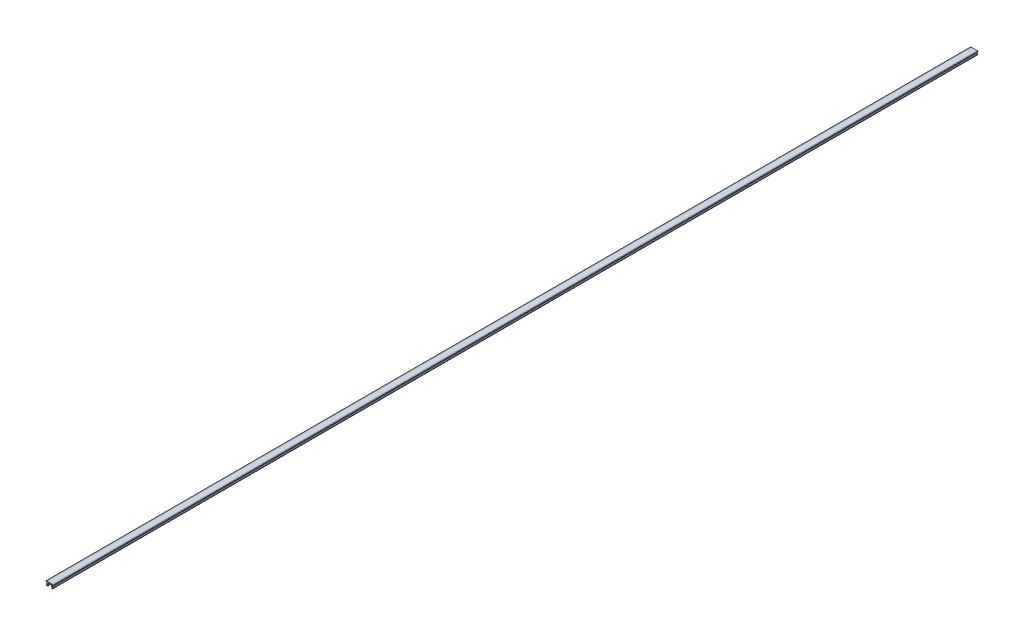
ISO-10303-21;
HEADER;
FILE_DESCRIPTION(('STEP AP214'),'2;1');
FILE_NAME('part.step','',(''),(''),'','','');
FILE_SCHEMA(('AUTOMOTIVE_DESIGN { 1 0 10303 214 1 1 1 1 }'));
ENDSEC;
DATA;
#1=APPLICATION_CONTEXT('core data for automotive mechanical design processes');
#2=APPLICATION_PROTOCOL_DEFINITION('international standard','automotive_design',2000,#1);
#3=PRODUCT_CONTEXT('',#1,'mechanical');
#4=PRODUCT('Part','Part','',(#3));
#5=PRODUCT_RELATED_PRODUCT_CATEGORY('part','',(#4));
#6=PRODUCT_DEFINITION_FORMATION('','',#4);
#7=PRODUCT_DEFINITION_CONTEXT('part definition',#1,'design');
#8=PRODUCT_DEFINITION('design','',#6,#7);
#9=PRODUCT_DEFINITION_SHAPE('','',#8);
#10=(LENGTH_UNIT() NAMED_UNIT(*) SI_UNIT(.MILLI.,.METRE.));
#11=(NAMED_UNIT(*) PLANE_ANGLE_UNIT() SI_UNIT($,.RADIAN.));
#12=(NAMED_UNIT(*) SI_UNIT($,.STERADIAN.) SOLID_ANGLE_UNIT());
#13=UNCERTAINTY_MEASURE_WITH_UNIT(LENGTH_MEASURE(1.E-05),#10,'distance_accuracy_value','');
#14=(GEOMETRIC_REPRESENTATION_CONTEXT(3) GLOBAL_UNCERTAINTY_ASSIGNED_CONTEXT((#13)) GLOBAL_UNIT_ASSIGNED_CONTEXT((#10,
#11,#12)) REPRESENTATION_CONTEXT('',''));
#15=CARTESIAN_POINT('',(0.,0.,0.));
#16=DIRECTION('',(0.,0.,1.));
#17=DIRECTION('',(1.,0.,0.));
#18=AXIS2_PLACEMENT_3D('',#15,#16,#17);
#19=CARTESIAN_POINT('',(-3.1,0.,1000.));
#20=DIRECTION('',(0.,-1.,0.));
#21=DIRECTION('',(1.,0.,0.));
#22=AXIS2_PLACEMENT_3D('',#19,#20,#21);
#23=PLANE('',#22);
#24=DIRECTION('',(-1.,0.,0.));
#25=VECTOR('',#24,1.);
#26=CARTESIAN_POINT('',(-3.1,0.,0.));
#27=LINE('',#26,#25);
#28=CARTESIAN_POINT('',(3.1,0.,0.));
#29=VERTEX_POINT('',#28);
#30=CARTESIAN_POINT('',(-3.1,0.,0.));
#31=VERTEX_POINT('',#30);
#32=EDGE_CURVE('E215',#29,#31,#27,.T.);
#33=ORIENTED_EDGE('',*,*,#32,.T.);
#34=DIRECTION('',(0.,0.,-1.));
#35=VECTOR('',#34,1.);
#36=CARTESIAN_POINT('',(-3.1,0.,1000.));
#37=LINE('',#36,#35);
#38=CARTESIAN_POINT('',(-3.1,0.,1000.));
#39=VERTEX_POINT('',#38);
#40=EDGE_CURVE('E11',#39,#31,#37,.T.);
#41=ORIENTED_EDGE('',*,*,#40,.F.);
#42=DIRECTION('',(-1.,0.,0.));
#43=VECTOR('',#42,1.);
#44=CARTESIAN_POINT('',(-3.1,0.,1000.));
#45=LINE('',#44,#43);
#46=CARTESIAN_POINT('',(3.1,0.,1000.));
#47=VERTEX_POINT('',#46);
#48=EDGE_CURVE('E257',#47,#39,#45,.T.);
#49=ORIENTED_EDGE('',*,*,#48,.F.);
#50=DIRECTION('',(0.,0.,-1.));
#51=VECTOR('',#50,1.);
#52=CARTESIAN_POINT('',(3.1,0.,1000.));
#53=LINE('',#52,#51);
#54=EDGE_CURVE('E211',#47,#29,#53,.T.);
#55=ORIENTED_EDGE('',*,*,#54,.T.);
#56=EDGE_LOOP('',(#33,#41,#49,#55));
#57=FACE_BOUND('',#56,.T.);
#58=ADVANCED_FACE('F35',(#57),#23,.F.);
#59=CARTESIAN_POINT('',(-3.1,0.,1000.));
#60=DIRECTION('',(0.173648177666924,-0.984807753012209,0.));
#61=DIRECTION('',(0.984807753012209,0.173648177666924,0.));
#62=AXIS2_PLACEMENT_3D('',#59,#60,#61);
#63=PLANE('',#62);
#64=DIRECTION('',(-0.984807753012209,-0.173648177666924,0.));
#65=VECTOR('',#64,1.);
#66=CARTESIAN_POINT('',(-3.1,0.,0.));
#67=LINE('',#66,#65);
#68=CARTESIAN_POINT('',(-4.,-0.158694282637612,0.));
#69=VERTEX_POINT('',#68);
#70=EDGE_CURVE('E218',#31,#69,#67,.T.);
#71=ORIENTED_EDGE('',*,*,#70,.T.);
#72=DIRECTION('',(0.,0.,-1.));
#73=VECTOR('',#72,1.);
#74=CARTESIAN_POINT('',(-4.,-0.158694282637612,1000.));
#75=LINE('',#74,#73);
#76=CARTESIAN_POINT('',(-4.,-0.158694282637612,1000.));
#77=VERTEX_POINT('',#76);
#78=EDGE_CURVE('E43',#77,#69,#75,.T.);
#79=ORIENTED_EDGE('',*,*,#78,.F.);
#80=DIRECTION('',(-0.984807753012209,-0.173648177666924,0.));
#81=VECTOR('',#80,1.);
#82=CARTESIAN_POINT('',(-3.1,0.,1000.));
#83=LINE('',#82,#81);
#84=EDGE_CURVE('E136',#39,#77,#83,.T.);
#85=ORIENTED_EDGE('',*,*,#84,.F.);
#86=ORIENTED_EDGE('',*,*,#40,.T.);
#87=EDGE_LOOP('',(#71,#79,#85,#86));
#88=FACE_BOUND('',#87,.T.);
#89=ADVANCED_FACE('F385',(#88),#63,.F.);
#90=CARTESIAN_POINT('',(-4.,-0.158694282637612,1000.));
#91=DIRECTION('',(1.,0.,0.));
#92=DIRECTION('',(0.,0.,-1.));
#93=AXIS2_PLACEMENT_3D('',#90,#91,#92);
#94=PLANE('',#93);
#95=DIRECTION('',(0.,-1.,0.));
#96=VECTOR('',#95,1.);
#97=CARTESIAN_POINT('',(-4.,-0.158694282637612,0.));
#98=LINE('',#97,#96);
#99=CARTESIAN_POINT('',(-4.,-0.8,0.));
#100=VERTEX_POINT('',#99);
#101=EDGE_CURVE('E220',#69,#100,#98,.T.);
#102=ORIENTED_EDGE('',*,*,#101,.T.);
#103=DIRECTION('',(0.,0.,-1.));
#104=VECTOR('',#103,1.);
#105=CARTESIAN_POINT('',(-4.,-0.8,1000.));
#106=LINE('',#105,#104);
#107=CARTESIAN_POINT('',(-4.,-0.8,1000.));
#108=VERTEX_POINT('',#107);
#109=EDGE_CURVE('E306',#108,#100,#106,.T.);
#110=ORIENTED_EDGE('',*,*,#109,.F.);
#111=DIRECTION('',(0.,-1.,0.));
#112=VECTOR('',#111,1.);
#113=CARTESIAN_POINT('',(-4.,-0.158694282637612,1000.));
#114=LINE('',#113,#112);
#115=EDGE_CURVE('E314',#77,#108,#114,.T.);
#116=ORIENTED_EDGE('',*,*,#115,.F.);
#117=ORIENTED_EDGE('',*,*,#78,.T.);
#118=EDGE_LOOP('',(#102,#110,#116,#117));
#119=FACE_BOUND('',#118,.T.);
#120=ADVANCED_FACE('F312',(#119),#94,.F.);
#121=CARTESIAN_POINT('',(-4.,-0.8,1000.));
#122=DIRECTION('',(0.,1.,0.));
#123=DIRECTION('',(0.,0.,1.));
#124=AXIS2_PLACEMENT_3D('',#121,#122,#123);
#125=PLANE('',#124);
#126=DIRECTION('',(1.,0.,0.));
#127=VECTOR('',#126,1.);
#128=CARTESIAN_POINT('',(-4.,-0.8,0.));
#129=LINE('',#128,#127);
#130=CARTESIAN_POINT('',(-3.1,-0.8,0.));
#131=VERTEX_POINT('',#130);
#132=EDGE_CURVE('E222',#100,#131,#129,.T.);
#133=ORIENTED_EDGE('',*,*,#132,.T.);
#134=DIRECTION('',(0.,0.,-1.));
#135=VECTOR('',#134,1.);
#136=CARTESIAN_POINT('',(-3.1,-0.8,1000.));
#137=LINE('',#136,#135);
#138=CARTESIAN_POINT('',(-3.1,-0.8,1000.));
#139=VERTEX_POINT('',#138);
#140=EDGE_CURVE('E303',#139,#131,#137,.T.);
#141=ORIENTED_EDGE('',*,*,#140,.F.);
#142=DIRECTION('',(1.,0.,0.));
#143=VECTOR('',#142,1.);
#144=CARTESIAN_POINT('',(-4.,-0.8,1000.));
#145=LINE('',#144,#143);
#146=EDGE_CURVE('E332',#108,#139,#145,.T.);
#147=ORIENTED_EDGE('',*,*,#146,.F.);
#148=ORIENTED_EDGE('',*,*,#109,.T.);
#149=EDGE_LOOP('',(#133,#141,#147,#148));
#150=FACE_BOUND('',#149,.T.);
#151=ADVANCED_FACE('F323',(#150),#125,.F.);
#152=CARTESIAN_POINT('',(-3.1,-0.8,1000.));
#153=DIRECTION('',(1.,0.,0.));
#154=DIRECTION('',(0.,1.,0.));
#155=AXIS2_PLACEMENT_3D('',#152,#153,#154);
#156=PLANE('',#155);
#157=DIRECTION('',(0.,-1.,0.));
#158=VECTOR('',#157,1.);
#159=CARTESIAN_POINT('',(-3.1,-0.8,0.));
#160=LINE('',#159,#158);
#161=CARTESIAN_POINT('',(-3.1,-2.19615242270663,0.));
#162=VERTEX_POINT('',#161);
#163=EDGE_CURVE('E224',#131,#162,#160,.T.);
#164=ORIENTED_EDGE('',*,*,#163,.T.);
#165=DIRECTION('',(0.,0.,-1.));
#166=VECTOR('',#165,1.);
#167=CARTESIAN_POINT('',(-3.1,-2.19615242270663,1000.));
#168=LINE('',#167,#166);
#169=CARTESIAN_POINT('',(-3.1,-2.19615242270663,1000.));
#170=VERTEX_POINT('',#169);
#171=EDGE_CURVE('E300',#170,#162,#168,.T.);
#172=ORIENTED_EDGE('',*,*,#171,.F.);
#173=DIRECTION('',(0.,-1.,0.));
#174=VECTOR('',#173,1.);
#175=CARTESIAN_POINT('',(-3.1,-0.8,1000.));
#176=LINE('',#175,#174);
#177=EDGE_CURVE('E329',#139,#170,#176,.T.);
#178=ORIENTED_EDGE('',*,*,#177,.F.);
#179=ORIENTED_EDGE('',*,*,#140,.T.);
#180=EDGE_LOOP('',(#164,#172,#178,#179));
#181=FACE_BOUND('',#180,.T.);
#182=ADVANCED_FACE('F327',(#181),#156,.F.);
#183=CARTESIAN_POINT('',(-3.1,-2.19615242270663,1000.));
#184=DIRECTION('',(0.866025403784438,-0.500000000000001,0.));
#185=DIRECTION('',(0.500000000000001,0.866025403784438,0.));
#186=AXIS2_PLACEMENT_3D('',#183,#184,#185);
#187=PLANE('',#186);
#188=DIRECTION('',(-0.500000000000001,-0.866025403784438,0.));
#189=VECTOR('',#188,1.);
#190=CARTESIAN_POINT('',(-3.1,-2.19615242270663,0.));
#191=LINE('',#190,#189);
#192=CARTESIAN_POINT('',(-3.68771324027147,-3.21410161513775,0.));
#193=VERTEX_POINT('',#192);
#194=EDGE_CURVE('E226',#162,#193,#191,.T.);
#195=ORIENTED_EDGE('',*,*,#194,.T.);
#196=DIRECTION('',(0.,0.,-1.));
#197=VECTOR('',#196,1.);
#198=CARTESIAN_POINT('',(-3.68771324027147,-3.21410161513775,1000.));
#199=LINE('',#198,#197);
#200=CARTESIAN_POINT('',(-3.68771324027147,-3.21410161513775,1000.));
#201=VERTEX_POINT('',#200);
#202=EDGE_CURVE('E297',#201,#193,#199,.T.);
#203=ORIENTED_EDGE('',*,*,#202,.F.);
#204=DIRECTION('',(-0.500000000000001,-0.866025403784438,0.));
#205=VECTOR('',#204,1.);
#206=CARTESIAN_POINT('',(-3.1,-2.19615242270663,1000.));
#207=LINE('',#206,#205);
#208=EDGE_CURVE('E331',#170,#201,#207,.T.);
#209=ORIENTED_EDGE('',*,*,#208,.F.);
#210=ORIENTED_EDGE('',*,*,#171,.T.);
#211=EDGE_LOOP('',(#195,#203,#209,#210));
#212=FACE_BOUND('',#211,.T.);
#213=ADVANCED_FACE('F398',(#212),#187,.F.);
#214=CARTESIAN_POINT('',(-3.68771324027147,-3.21410161513775,1000.));
#215=DIRECTION('',(0.866025403784438,0.500000000000001,0.));
#216=DIRECTION('',(-0.500000000000001,0.866025403784438,0.));
#217=AXIS2_PLACEMENT_3D('',#214,#215,#216);
#218=PLANE('',#217);
#219=DIRECTION('',(0.500000000000001,-0.866025403784438,0.));
#220=VECTOR('',#219,1.);
#221=CARTESIAN_POINT('',(-3.68771324027147,-3.21410161513775,0.));
#222=LINE('',#221,#220);
#223=CARTESIAN_POINT('',(-3.1,-4.23205080756888,0.));
#224=VERTEX_POINT('',#223);
#225=EDGE_CURVE('E228',#193,#224,#222,.T.);
#226=ORIENTED_EDGE('',*,*,#225,.T.);
#227=DIRECTION('',(0.,0.,-1.));
#228=VECTOR('',#227,1.);
#229=CARTESIAN_POINT('',(-3.1,-4.23205080756888,1000.));
#230=LINE('',#229,#228);
#231=CARTESIAN_POINT('',(-3.1,-4.23205080756888,1000.));
#232=VERTEX_POINT('',#231);
#233=EDGE_CURVE('E294',#232,#224,#230,.T.);
#234=ORIENTED_EDGE('',*,*,#233,.F.);
#235=DIRECTION('',(0.500000000000001,-0.866025403784438,0.));
#236=VECTOR('',#235,1.);
#237=CARTESIAN_POINT('',(-3.68771324027147,-3.21410161513775,1000.));
#238=LINE('',#237,#236);
#239=EDGE_CURVE('E334',#201,#232,#238,.T.);
#240=ORIENTED_EDGE('',*,*,#239,.F.);
#241=ORIENTED_EDGE('',*,*,#202,.T.);
#242=EDGE_LOOP('',(#226,#234,#240,#241));
#243=FACE_BOUND('',#242,.T.);
#244=ADVANCED_FACE('F401',(#243),#218,.F.);
#245=CARTESIAN_POINT('',(-2.63589838486224,-3.96410161513775,1000.));
#246=DIRECTION('',(0.,0.,-1.));
#247=DIRECTION('',(-1.,0.,0.));
#248=AXIS2_PLACEMENT_3D('',#245,#246,#247);
#249=CYLINDRICAL_SURFACE('',#248,0.535898384862246);
#250=CARTESIAN_POINT('',(-2.63589838486224,-3.96410161513775,0.));
#251=DIRECTION('',(0.,0.,1.));
#252=DIRECTION('',(1.,0.,0.));
#253=AXIS2_PLACEMENT_3D('',#250,#251,#252);
#254=CIRCLE('',#253,0.535898384862246);
#255=CARTESIAN_POINT('',(-2.1,-3.96410161513775,0.));
#256=VERTEX_POINT('',#255);
#257=EDGE_CURVE('E230',#224,#256,#254,.T.);
#258=ORIENTED_EDGE('',*,*,#257,.T.);
#259=DIRECTION('',(0.,0.,-1.));
#260=VECTOR('',#259,1.);
#261=CARTESIAN_POINT('',(-2.1,-3.96410161513775,1000.));
#262=LINE('',#261,#260);
#263=CARTESIAN_POINT('',(-2.1,-3.96410161513775,1000.));
#264=VERTEX_POINT('',#263);
#265=EDGE_CURVE('E291',#264,#256,#262,.T.);
#266=ORIENTED_EDGE('',*,*,#265,.F.);
#267=CARTESIAN_POINT('',(-2.63589838486224,-3.96410161513775,1000.));
#268=DIRECTION('',(0.,0.,1.));
#269=DIRECTION('',(1.,0.,0.));
#270=AXIS2_PLACEMENT_3D('',#267,#268,#269);
#271=CIRCLE('',#270,0.535898384862246);
#272=EDGE_CURVE('E340',#232,#264,#271,.T.);
#273=ORIENTED_EDGE('',*,*,#272,.F.);
#274=ORIENTED_EDGE('',*,*,#233,.T.);
#275=EDGE_LOOP('',(#258,#266,#273,#274));
#276=FACE_BOUND('',#275,.T.);
#277=ADVANCED_FACE('F405',(#276),#249,.T.);
#278=CARTESIAN_POINT('',(-2.1,-3.96410161513775,1000.));
#279=DIRECTION('',(-0.866025403784438,-0.500000000000002,0.));
#280=DIRECTION('',(0.500000000000002,-0.866025403784438,0.));
#281=AXIS2_PLACEMENT_3D('',#278,#279,#280);
#282=PLANE('',#281);
#283=DIRECTION('',(-0.500000000000002,0.866025403784438,0.));
#284=VECTOR('',#283,1.);
#285=CARTESIAN_POINT('',(-2.1,-3.96410161513775,0.));
#286=LINE('',#285,#284);
#287=CARTESIAN_POINT('',(-2.53301270189222,-3.21410161513775,0.));
#288=VERTEX_POINT('',#287);
#289=EDGE_CURVE('E232',#256,#288,#286,.T.);
#290=ORIENTED_EDGE('',*,*,#289,.T.);
#291=DIRECTION('',(0.,0.,-1.));
#292=VECTOR('',#291,1.);
#293=CARTESIAN_POINT('',(-2.53301270189222,-3.21410161513775,1000.));
#294=LINE('',#293,#292);
#295=CARTESIAN_POINT('',(-2.53301270189222,-3.21410161513775,1000.));
#296=VERTEX_POINT('',#295);
#297=EDGE_CURVE('E288',#296,#288,#294,.T.);
#298=ORIENTED_EDGE('',*,*,#297,.F.);
#299=DIRECTION('',(-0.500000000000002,0.866025403784438,0.));
#300=VECTOR('',#299,1.);
#301=CARTESIAN_POINT('',(-2.1,-3.96410161513775,1000.));
#302=LINE('',#301,#300);
#303=EDGE_CURVE('E342',#264,#296,#302,.T.);
#304=ORIENTED_EDGE('',*,*,#303,.F.);
#305=ORIENTED_EDGE('',*,*,#265,.T.);
#306=EDGE_LOOP('',(#290,#298,#304,#305));
#307=FACE_BOUND('',#306,.T.);
#308=ADVANCED_FACE('F409',(#307),#282,.F.);
#309=CARTESIAN_POINT('',(-2.53301270189222,-3.21410161513775,1000.));
#310=DIRECTION('',(-0.866025403784438,0.500000000000001,0.));
#311=DIRECTION('',(-0.500000000000001,-0.866025403784438,0.));
#312=AXIS2_PLACEMENT_3D('',#309,#310,#311);
#313=PLANE('',#312);
#314=DIRECTION('',(0.500000000000001,0.866025403784438,0.));
#315=VECTOR('',#314,1.);
#316=CARTESIAN_POINT('',(-2.53301270189222,-3.21410161513775,0.));
#317=LINE('',#316,#315);
#318=CARTESIAN_POINT('',(-2.1,-2.46410161513775,0.));
#319=VERTEX_POINT('',#318);
#320=EDGE_CURVE('E234',#288,#319,#317,.T.);
#321=ORIENTED_EDGE('',*,*,#320,.T.);
#322=DIRECTION('',(0.,0.,-1.));
#323=VECTOR('',#322,1.);
#324=CARTESIAN_POINT('',(-2.1,-2.46410161513775,1000.));
#325=LINE('',#324,#323);
#326=CARTESIAN_POINT('',(-2.1,-2.46410161513775,1000.));
#327=VERTEX_POINT('',#326);
#328=EDGE_CURVE('E285',#327,#319,#325,.T.);
#329=ORIENTED_EDGE('',*,*,#328,.F.);
#330=DIRECTION('',(0.500000000000001,0.866025403784438,0.));
#331=VECTOR('',#330,1.);
#332=CARTESIAN_POINT('',(-2.53301270189222,-3.21410161513775,1000.));
#333=LINE('',#332,#331);
#334=EDGE_CURVE('E344',#296,#327,#333,.T.);
#335=ORIENTED_EDGE('',*,*,#334,.F.);
#336=ORIENTED_EDGE('',*,*,#297,.T.);
#337=EDGE_LOOP('',(#321,#329,#335,#336));
#338=FACE_BOUND('',#337,.T.);
#339=ADVANCED_FACE('F413',(#338),#313,.F.);
#340=CARTESIAN_POINT('',(-2.1,-2.46410161513775,1000.));
#341=DIRECTION('',(-1.,0.,0.));
#342=DIRECTION('',(0.,-1.,0.));
#343=AXIS2_PLACEMENT_3D('',#340,#341,#342);
#344=PLANE('',#343);
#345=DIRECTION('',(0.,1.,0.));
#346=VECTOR('',#345,1.);
#347=CARTESIAN_POINT('',(-2.1,-2.46410161513775,0.));
#348=LINE('',#347,#346);
#349=CARTESIAN_POINT('',(-2.1,-1.,0.));
#350=VERTEX_POINT('',#349);
#351=EDGE_CURVE('E236',#319,#350,#348,.T.);
#352=ORIENTED_EDGE('',*,*,#351,.T.);
#353=DIRECTION('',(0.,0.,-1.));
#354=VECTOR('',#353,1.);
#355=CARTESIAN_POINT('',(-2.1,-1.,1000.));
#356=LINE('',#355,#354);
#357=CARTESIAN_POINT('',(-2.1,-1.,1000.));
#358=VERTEX_POINT('',#357);
#359=EDGE_CURVE('E282',#358,#350,#356,.T.);
#360=ORIENTED_EDGE('',*,*,#359,.F.);
#361=DIRECTION('',(0.,1.,0.));
#362=VECTOR('',#361,1.);
#363=CARTESIAN_POINT('',(-2.1,-2.46410161513775,1000.));
#364=LINE('',#363,#362);
#365=EDGE_CURVE('E346',#327,#358,#364,.T.);
#366=ORIENTED_EDGE('',*,*,#365,.F.);
#367=ORIENTED_EDGE('',*,*,#328,.T.);
#368=EDGE_LOOP('',(#352,#360,#366,#367));
#369=FACE_BOUND('',#368,.T.);
#370=ADVANCED_FACE('F417',(#369),#344,.F.);
#371=CARTESIAN_POINT('',(-2.1,-1.,1000.));
#372=DIRECTION('',(0.,1.,0.));
#373=DIRECTION('',(-1.,0.,0.));
#374=AXIS2_PLACEMENT_3D('',#371,#372,#373);
#375=PLANE('',#374);
#376=DIRECTION('',(1.,0.,0.));
#377=VECTOR('',#376,1.);
#378=CARTESIAN_POINT('',(-2.1,-1.,0.));
#379=LINE('',#378,#377);
#380=CARTESIAN_POINT('',(2.1,-1.,0.));
#381=VERTEX_POINT('',#380);
#382=EDGE_CURVE('E238',#350,#381,#379,.T.);
#383=ORIENTED_EDGE('',*,*,#382,.T.);
#384=DIRECTION('',(0.,0.,-1.));
#385=VECTOR('',#384,1.);
#386=CARTESIAN_POINT('',(2.1,-1.,1000.));
#387=LINE('',#386,#385);
#388=CARTESIAN_POINT('',(2.1,-1.,1000.));
#389=VERTEX_POINT('',#388);
#390=EDGE_CURVE('E279',#389,#381,#387,.T.);
#391=ORIENTED_EDGE('',*,*,#390,.F.);
#392=DIRECTION('',(1.,0.,0.));
#393=VECTOR('',#392,1.);
#394=CARTESIAN_POINT('',(-2.1,-1.,1000.));
#395=LINE('',#394,#393);
#396=EDGE_CURVE('E348',#358,#389,#395,.T.);
#397=ORIENTED_EDGE('',*,*,#396,.F.);
#398=ORIENTED_EDGE('',*,*,#359,.T.);
#399=EDGE_LOOP('',(#383,#391,#397,#398));
#400=FACE_BOUND('',#399,.T.);
#401=ADVANCED_FACE('F421',(#400),#375,.F.);
#402=CARTESIAN_POINT('',(2.1,-2.46410161513775,1000.));
#403=DIRECTION('',(1.,0.,0.));
#404=DIRECTION('',(0.,1.,0.));
#405=AXIS2_PLACEMENT_3D('',#402,#403,#404);
#406=PLANE('',#405);
#407=DIRECTION('',(0.,-1.,0.));
#408=VECTOR('',#407,1.);
#409=CARTESIAN_POINT('',(2.1,-2.46410161513775,0.));
#410=LINE('',#409,#408);
#411=CARTESIAN_POINT('',(2.1,-2.46410161513775,0.));
#412=VERTEX_POINT('',#411);
#413=EDGE_CURVE('E240',#381,#412,#410,.T.);
#414=ORIENTED_EDGE('',*,*,#413,.T.);
#415=DIRECTION('',(0.,0.,-1.));
#416=VECTOR('',#415,1.);
#417=CARTESIAN_POINT('',(2.1,-2.46410161513775,1000.));
#418=LINE('',#417,#416);
#419=CARTESIAN_POINT('',(2.1,-2.46410161513775,1000.));
#420=VERTEX_POINT('',#419);
#421=EDGE_CURVE('E276',#420,#412,#418,.T.);
#422=ORIENTED_EDGE('',*,*,#421,.F.);
#423=DIRECTION('',(0.,-1.,0.));
#424=VECTOR('',#423,1.);
#425=CARTESIAN_POINT('',(2.1,-2.46410161513775,1000.));
#426=LINE('',#425,#424);
#427=EDGE_CURVE('E350',#389,#420,#426,.T.);
#428=ORIENTED_EDGE('',*,*,#427,.F.);
#429=ORIENTED_EDGE('',*,*,#390,.T.);
#430=EDGE_LOOP('',(#414,#422,#428,#429));
#431=FACE_BOUND('',#430,.T.);
#432=ADVANCED_FACE('F425',(#431),#406,.F.);
#433=CARTESIAN_POINT('',(2.53301270189222,-3.21410161513775,1000.));
#434=DIRECTION('',(0.866025403784438,0.500000000000001,0.));
#435=DIRECTION('',(-0.500000000000001,0.866025403784438,0.));
#436=AXIS2_PLACEMENT_3D('',#433,#434,#435);
#437=PLANE('',#436);
#438=DIRECTION('',(0.500000000000001,-0.866025403784438,0.));
#439=VECTOR('',#438,1.);
#440=CARTESIAN_POINT('',(2.53301270189222,-3.21410161513775,0.));
#441=LINE('',#440,#439);
#442=CARTESIAN_POINT('',(2.53301270189222,-3.21410161513775,0.));
#443=VERTEX_POINT('',#442);
#444=EDGE_CURVE('E242',#412,#443,#441,.T.);
#445=ORIENTED_EDGE('',*,*,#444,.T.);
#446=DIRECTION('',(0.,0.,-1.));
#447=VECTOR('',#446,1.);
#448=CARTESIAN_POINT('',(2.53301270189222,-3.21410161513775,1000.));
#449=LINE('',#448,#447);
#450=CARTESIAN_POINT('',(2.53301270189222,-3.21410161513775,1000.));
#451=VERTEX_POINT('',#450);
#452=EDGE_CURVE('E273',#451,#443,#449,.T.);
#453=ORIENTED_EDGE('',*,*,#452,.F.);
#454=DIRECTION('',(0.500000000000001,-0.866025403784438,0.));
#455=VECTOR('',#454,1.);
#456=CARTESIAN_POINT('',(2.53301270189222,-3.21410161513775,1000.));
#457=LINE('',#456,#455);
#458=EDGE_CURVE('E352',#420,#451,#457,.T.);
#459=ORIENTED_EDGE('',*,*,#458,.F.);
#460=ORIENTED_EDGE('',*,*,#421,.T.);
#461=EDGE_LOOP('',(#445,#453,#459,#460));
#462=FACE_BOUND('',#461,.T.);
#463=ADVANCED_FACE('F429',(#462),#437,.F.);
#464=CARTESIAN_POINT('',(2.1,-3.96410161513775,1000.));
#465=DIRECTION('',(0.866025403784438,-0.500000000000002,0.));
#466=DIRECTION('',(0.500000000000002,0.866025403784437,0.));
#467=AXIS2_PLACEMENT_3D('',#464,#465,#466);
#468=PLANE('',#467);
#469=DIRECTION('',(-0.500000000000002,-0.866025403784437,0.));
#470=VECTOR('',#469,1.);
#471=CARTESIAN_POINT('',(2.1,-3.96410161513775,0.));
#472=LINE('',#471,#470);
#473=CARTESIAN_POINT('',(2.1,-3.96410161513775,0.));
#474=VERTEX_POINT('',#473);
#475=EDGE_CURVE('E244',#443,#474,#472,.T.);
#476=ORIENTED_EDGE('',*,*,#475,.T.);
#477=DIRECTION('',(0.,0.,-1.));
#478=VECTOR('',#477,1.);
#479=CARTESIAN_POINT('',(2.1,-3.96410161513775,1000.));
#480=LINE('',#479,#478);
#481=CARTESIAN_POINT('',(2.1,-3.96410161513775,1000.));
#482=VERTEX_POINT('',#481);
#483=EDGE_CURVE('E270',#482,#474,#480,.T.);
#484=ORIENTED_EDGE('',*,*,#483,.F.);
#485=DIRECTION('',(-0.500000000000002,-0.866025403784437,0.));
#486=VECTOR('',#485,1.);
#487=CARTESIAN_POINT('',(2.1,-3.96410161513775,1000.));
#488=LINE('',#487,#486);
#489=EDGE_CURVE('E354',#451,#482,#488,.T.);
#490=ORIENTED_EDGE('',*,*,#489,.F.);
#491=ORIENTED_EDGE('',*,*,#452,.T.);
#492=EDGE_LOOP('',(#476,#484,#490,#491));
#493=FACE_BOUND('',#492,.T.);
#494=ADVANCED_FACE('F433',(#493),#468,.F.);
#495=CARTESIAN_POINT('',(2.63589838486224,-3.96410161513775,1000.));
#496=DIRECTION('',(0.,0.,-1.));
#497=DIRECTION('',(-1.,0.,0.));
#498=AXIS2_PLACEMENT_3D('',#495,#496,#497);
#499=CYLINDRICAL_SURFACE('',#498,0.535898384862246);
#500=CARTESIAN_POINT('',(2.63589838486224,-3.96410161513775,0.));
#501=DIRECTION('',(0.,0.,1.));
#502=DIRECTION('',(-1.,0.,0.));
#503=AXIS2_PLACEMENT_3D('',#500,#501,#502);
#504=CIRCLE('',#503,0.535898384862246);
#505=CARTESIAN_POINT('',(3.1,-4.23205080756888,0.));
#506=VERTEX_POINT('',#505);
#507=EDGE_CURVE('E246',#474,#506,#504,.T.);
#508=ORIENTED_EDGE('',*,*,#507,.T.);
#509=DIRECTION('',(0.,0.,-1.));
#510=VECTOR('',#509,1.);
#511=CARTESIAN_POINT('',(3.1,-4.23205080756888,1000.));
#512=LINE('',#511,#510);
#513=CARTESIAN_POINT('',(3.1,-4.23205080756888,1000.));
#514=VERTEX_POINT('',#513);
#515=EDGE_CURVE('E267',#514,#506,#512,.T.);
#516=ORIENTED_EDGE('',*,*,#515,.F.);
#517=CARTESIAN_POINT('',(2.63589838486224,-3.96410161513775,1000.));
#518=DIRECTION('',(0.,0.,1.));
#519=DIRECTION('',(-1.,0.,0.));
#520=AXIS2_PLACEMENT_3D('',#517,#518,#519);
#521=CIRCLE('',#520,0.535898384862246);
#522=EDGE_CURVE('E356',#482,#514,#521,.T.);
#523=ORIENTED_EDGE('',*,*,#522,.F.);
#524=ORIENTED_EDGE('',*,*,#483,.T.);
#525=EDGE_LOOP('',(#508,#516,#523,#524));
#526=FACE_BOUND('',#525,.T.);
#527=ADVANCED_FACE('F437',(#526),#499,.T.);
#528=CARTESIAN_POINT('',(3.68771324027147,-3.21410161513775,1000.));
#529=DIRECTION('',(-0.866025403784438,0.500000000000001,0.));
#530=DIRECTION('',(-0.500000000000001,-0.866025403784438,0.));
#531=AXIS2_PLACEMENT_3D('',#528,#529,#530);
#532=PLANE('',#531);
#533=DIRECTION('',(0.500000000000001,0.866025403784438,0.));
#534=VECTOR('',#533,1.);
#535=CARTESIAN_POINT('',(3.68771324027147,-3.21410161513775,0.));
#536=LINE('',#535,#534);
#537=CARTESIAN_POINT('',(3.68771324027147,-3.21410161513775,0.));
#538=VERTEX_POINT('',#537);
#539=EDGE_CURVE('E248',#506,#538,#536,.T.);
#540=ORIENTED_EDGE('',*,*,#539,.T.);
#541=DIRECTION('',(0.,0.,-1.));
#542=VECTOR('',#541,1.);
#543=CARTESIAN_POINT('',(3.68771324027147,-3.21410161513775,1000.));
#544=LINE('',#543,#542);
#545=CARTESIAN_POINT('',(3.68771324027147,-3.21410161513775,1000.));
#546=VERTEX_POINT('',#545);
#547=EDGE_CURVE('E264',#546,#538,#544,.T.);
#548=ORIENTED_EDGE('',*,*,#547,.F.);
#549=DIRECTION('',(0.500000000000001,0.866025403784438,0.));
#550=VECTOR('',#549,1.);
#551=CARTESIAN_POINT('',(3.68771324027147,-3.21410161513775,1000.));
#552=LINE('',#551,#550);
#553=EDGE_CURVE('E358',#514,#546,#552,.T.);
#554=ORIENTED_EDGE('',*,*,#553,.F.);
#555=ORIENTED_EDGE('',*,*,#515,.T.);
#556=EDGE_LOOP('',(#540,#548,#554,#555));
#557=FACE_BOUND('',#556,.T.);
#558=ADVANCED_FACE('F441',(#557),#532,.F.);
#559=CARTESIAN_POINT('',(3.1,-2.19615242270663,1000.));
#560=DIRECTION('',(-0.866025403784438,-0.500000000000001,0.));
#561=DIRECTION('',(0.500000000000001,-0.866025403784438,0.));
#562=AXIS2_PLACEMENT_3D('',#559,#560,#561);
#563=PLANE('',#562);
#564=DIRECTION('',(-0.500000000000001,0.866025403784438,0.));
#565=VECTOR('',#564,1.);
#566=CARTESIAN_POINT('',(3.1,-2.19615242270663,0.));
#567=LINE('',#566,#565);
#568=CARTESIAN_POINT('',(3.1,-2.19615242270663,0.));
#569=VERTEX_POINT('',#568);
#570=EDGE_CURVE('E250',#538,#569,#567,.T.);
#571=ORIENTED_EDGE('',*,*,#570,.T.);
#572=DIRECTION('',(0.,0.,-1.));
#573=VECTOR('',#572,1.);
#574=CARTESIAN_POINT('',(3.1,-2.19615242270663,1000.));
#575=LINE('',#574,#573);
#576=CARTESIAN_POINT('',(3.1,-2.19615242270663,1000.));
#577=VERTEX_POINT('',#576);
#578=EDGE_CURVE('E261',#577,#569,#575,.T.);
#579=ORIENTED_EDGE('',*,*,#578,.F.);
#580=DIRECTION('',(-0.500000000000001,0.866025403784438,0.));
#581=VECTOR('',#580,1.);
#582=CARTESIAN_POINT('',(3.1,-2.19615242270663,1000.));
#583=LINE('',#582,#581);
#584=EDGE_CURVE('E360',#546,#577,#583,.T.);
#585=ORIENTED_EDGE('',*,*,#584,.F.);
#586=ORIENTED_EDGE('',*,*,#547,.T.);
#587=EDGE_LOOP('',(#571,#579,#585,#586));
#588=FACE_BOUND('',#587,.T.);
#589=ADVANCED_FACE('F366',(#588),#563,.F.);
#590=CARTESIAN_POINT('',(3.1,-0.799999999999999,1000.));
#591=DIRECTION('',(-1.,0.,0.));
#592=DIRECTION('',(0.,-1.,0.));
#593=AXIS2_PLACEMENT_3D('',#590,#591,#592);
#594=PLANE('',#593);
#595=DIRECTION('',(0.,1.,0.));
#596=VECTOR('',#595,1.);
#597=CARTESIAN_POINT('',(3.1,-0.799999999999999,0.));
#598=LINE('',#597,#596);
#599=CARTESIAN_POINT('',(3.1,-0.799999999999999,0.));
#600=VERTEX_POINT('',#599);
#601=EDGE_CURVE('E252',#569,#600,#598,.T.);
#602=ORIENTED_EDGE('',*,*,#601,.T.);
#603=DIRECTION('',(0.,0.,-1.));
#604=VECTOR('',#603,1.);
#605=CARTESIAN_POINT('',(3.1,-0.799999999999999,1000.));
#606=LINE('',#605,#604);
#607=CARTESIAN_POINT('',(3.1,-0.799999999999999,1000.));
#608=VERTEX_POINT('',#607);
#609=EDGE_CURVE('E206',#608,#600,#606,.T.);
#610=ORIENTED_EDGE('',*,*,#609,.F.);
#611=DIRECTION('',(0.,1.,0.));
#612=VECTOR('',#611,1.);
#613=CARTESIAN_POINT('',(3.1,-0.799999999999999,1000.));
#614=LINE('',#613,#612);
#615=EDGE_CURVE('E197',#577,#608,#614,.T.);
#616=ORIENTED_EDGE('',*,*,#615,.F.);
#617=ORIENTED_EDGE('',*,*,#578,.T.);
#618=EDGE_LOOP('',(#602,#610,#616,#617));
#619=FACE_BOUND('',#618,.T.);
#620=ADVANCED_FACE('F370',(#619),#594,.F.);
#621=CARTESIAN_POINT('',(4.,-0.799999999999999,1000.));
#622=DIRECTION('',(0.,1.,0.));
#623=DIRECTION('',(-1.,0.,0.));
#624=AXIS2_PLACEMENT_3D('',#621,#622,#623);
#625=PLANE('',#624);
#626=DIRECTION('',(1.,0.,0.));
#627=VECTOR('',#626,1.);
#628=CARTESIAN_POINT('',(4.,-0.799999999999999,0.));
#629=LINE('',#628,#627);
#630=CARTESIAN_POINT('',(4.,-0.799999999999999,0.));
#631=VERTEX_POINT('',#630);
#632=EDGE_CURVE('E205',#600,#631,#629,.T.);
#633=ORIENTED_EDGE('',*,*,#632,.T.);
#634=DIRECTION('',(0.,0.,-1.));
#635=VECTOR('',#634,1.);
#636=CARTESIAN_POINT('',(4.,-0.799999999999999,1000.));
#637=LINE('',#636,#635);
#638=CARTESIAN_POINT('',(4.,-0.799999999999999,1000.));
#639=VERTEX_POINT('',#638);
#640=EDGE_CURVE('E202',#639,#631,#637,.T.);
#641=ORIENTED_EDGE('',*,*,#640,.F.);
#642=DIRECTION('',(1.,0.,0.));
#643=VECTOR('',#642,1.);
#644=CARTESIAN_POINT('',(4.,-0.799999999999999,1000.));
#645=LINE('',#644,#643);
#646=EDGE_CURVE('E191',#608,#639,#645,.T.);
#647=ORIENTED_EDGE('',*,*,#646,.F.);
#648=ORIENTED_EDGE('',*,*,#609,.T.);
#649=EDGE_LOOP('',(#633,#641,#647,#648));
#650=FACE_BOUND('',#649,.T.);
#651=ADVANCED_FACE('F203',(#650),#625,.F.);
#652=CARTESIAN_POINT('',(4.,-0.158694282637611,1000.));
#653=DIRECTION('',(-1.,0.,0.));
#654=DIRECTION('',(0.,0.,1.));
#655=AXIS2_PLACEMENT_3D('',#652,#653,#654);
#656=PLANE('',#655);
#657=DIRECTION('',(0.,1.,0.));
#658=VECTOR('',#657,1.);
#659=CARTESIAN_POINT('',(4.,-0.158694282637611,0.));
#660=LINE('',#659,#658);
#661=CARTESIAN_POINT('',(4.,-0.158694282637611,0.));
#662=VERTEX_POINT('',#661);
#663=EDGE_CURVE('E122',#631,#662,#660,.T.);
#664=ORIENTED_EDGE('',*,*,#663,.T.);
#665=DIRECTION('',(0.,0.,-1.));
#666=VECTOR('',#665,1.);
#667=CARTESIAN_POINT('',(4.,-0.158694282637611,1000.));
#668=LINE('',#667,#666);
#669=CARTESIAN_POINT('',(4.,-0.158694282637611,1000.));
#670=VERTEX_POINT('',#669);
#671=EDGE_CURVE('E207',#670,#662,#668,.T.);
#672=ORIENTED_EDGE('',*,*,#671,.F.);
#673=DIRECTION('',(0.,1.,0.));
#674=VECTOR('',#673,1.);
#675=CARTESIAN_POINT('',(4.,-0.158694282637611,1000.));
#676=LINE('',#675,#674);
#677=EDGE_CURVE('E195',#639,#670,#676,.T.);
#678=ORIENTED_EDGE('',*,*,#677,.F.);
#679=ORIENTED_EDGE('',*,*,#640,.T.);
#680=EDGE_LOOP('',(#664,#672,#678,#679));
#681=FACE_BOUND('',#680,.T.);
#682=ADVANCED_FACE('F209',(#681),#656,.F.);
#683=CARTESIAN_POINT('',(3.1,0.,1000.));
#684=DIRECTION('',(-0.173648177666924,-0.984807753012209,0.));
#685=DIRECTION('',(0.984807753012209,-0.173648177666924,0.));
#686=AXIS2_PLACEMENT_3D('',#683,#684,#685);
#687=PLANE('',#686);
#688=DIRECTION('',(-0.984807753012209,0.173648177666924,0.));
#689=VECTOR('',#688,1.);
#690=CARTESIAN_POINT('',(3.1,0.,0.));
#691=LINE('',#690,#689);
#692=EDGE_CURVE('E128',#662,#29,#691,.T.);
#693=ORIENTED_EDGE('',*,*,#692,.T.);
#694=ORIENTED_EDGE('',*,*,#54,.F.);
#695=DIRECTION('',(-0.984807753012209,0.173648177666924,0.));
#696=VECTOR('',#695,1.);
#697=CARTESIAN_POINT('',(3.1,0.,1000.));
#698=LINE('',#697,#696);
#699=EDGE_CURVE('E51',#670,#47,#698,.T.);
#700=ORIENTED_EDGE('',*,*,#699,.F.);
#701=ORIENTED_EDGE('',*,*,#671,.T.);
#702=EDGE_LOOP('',(#693,#694,#700,#701));
#703=FACE_BOUND('',#702,.T.);
#704=ADVANCED_FACE('F374',(#703),#687,.F.);
#705=CARTESIAN_POINT('',(2.63589838486224,-3.96410161513775,1000.));
#706=DIRECTION('',(0.,0.,-1.));
#707=DIRECTION('',(-1.,0.,0.));
#708=AXIS2_PLACEMENT_3D('',#705,#706,#707);
#709=PLANE('',#708);
#710=ORIENTED_EDGE('',*,*,#48,.T.);
#711=ORIENTED_EDGE('',*,*,#84,.T.);
#712=ORIENTED_EDGE('',*,*,#115,.T.);
#713=ORIENTED_EDGE('',*,*,#146,.T.);
#714=ORIENTED_EDGE('',*,*,#177,.T.);
#715=ORIENTED_EDGE('',*,*,#208,.T.);
#716=ORIENTED_EDGE('',*,*,#239,.T.);
#717=ORIENTED_EDGE('',*,*,#272,.T.);
#718=ORIENTED_EDGE('',*,*,#303,.T.);
#719=ORIENTED_EDGE('',*,*,#334,.T.);
#720=ORIENTED_EDGE('',*,*,#365,.T.);
#721=ORIENTED_EDGE('',*,*,#396,.T.);
#722=ORIENTED_EDGE('',*,*,#427,.T.);
#723=ORIENTED_EDGE('',*,*,#458,.T.);
#724=ORIENTED_EDGE('',*,*,#489,.T.);
#725=ORIENTED_EDGE('',*,*,#522,.T.);
#726=ORIENTED_EDGE('',*,*,#553,.T.);
#727=ORIENTED_EDGE('',*,*,#584,.T.);
#728=ORIENTED_EDGE('',*,*,#615,.T.);
#729=ORIENTED_EDGE('',*,*,#646,.T.);
#730=ORIENTED_EDGE('',*,*,#677,.T.);
#731=ORIENTED_EDGE('',*,*,#699,.T.);
#732=EDGE_LOOP('',(#710,#711,#712,#713,#714,#715,#716,#717,#718,#719,#720,#721,#722,#723,#724,
#725,#726,#727,#728,#729,#730,#731));
#733=FACE_BOUND('',#732,.T.);
#734=ADVANCED_FACE('F193',(#733),#709,.F.);
#735=CARTESIAN_POINT('',(2.63589838486224,-3.96410161513775,0.));
#736=DIRECTION('',(0.,0.,-1.));
#737=DIRECTION('',(-1.,0.,0.));
#738=AXIS2_PLACEMENT_3D('',#735,#736,#737);
#739=PLANE('',#738);
#740=ORIENTED_EDGE('',*,*,#32,.F.);
#741=ORIENTED_EDGE('',*,*,#692,.F.);
#742=ORIENTED_EDGE('',*,*,#663,.F.);
#743=ORIENTED_EDGE('',*,*,#632,.F.);
#744=ORIENTED_EDGE('',*,*,#601,.F.);
#745=ORIENTED_EDGE('',*,*,#570,.F.);
#746=ORIENTED_EDGE('',*,*,#539,.F.);
#747=ORIENTED_EDGE('',*,*,#507,.F.);
#748=ORIENTED_EDGE('',*,*,#475,.F.);
#749=ORIENTED_EDGE('',*,*,#444,.F.);
#750=ORIENTED_EDGE('',*,*,#413,.F.);
#751=ORIENTED_EDGE('',*,*,#382,.F.);
#752=ORIENTED_EDGE('',*,*,#351,.F.);
#753=ORIENTED_EDGE('',*,*,#320,.F.);
#754=ORIENTED_EDGE('',*,*,#289,.F.);
#755=ORIENTED_EDGE('',*,*,#257,.F.);
#756=ORIENTED_EDGE('',*,*,#225,.F.);
#757=ORIENTED_EDGE('',*,*,#194,.F.);
#758=ORIENTED_EDGE('',*,*,#163,.F.);
#759=ORIENTED_EDGE('',*,*,#132,.F.);
#760=ORIENTED_EDGE('',*,*,#101,.F.);
#761=ORIENTED_EDGE('',*,*,#70,.F.);
#762=EDGE_LOOP('',(#740,#741,#742,#743,#744,#745,#746,#747,#748,#749,#750,#751,#752,#753,#754,
#755,#756,#757,#758,#759,#760,#761));
#763=FACE_BOUND('',#762,.T.);
#764=ADVANCED_FACE('F318',(#763),#739,.T.);
#765=CLOSED_SHELL('',(#58,#89,#120,#151,#182,#213,#244,#277,#308,#339,#370,#401,#432,#463,#494,
#527,#558,#589,#620,#651,#682,#704,#734,#764));
#766=MANIFOLD_SOLID_BREP('B2',#765);
#767=ADVANCED_BREP_SHAPE_REPRESENTATION('',(#18,#766),#14);
#768=SHAPE_DEFINITION_REPRESENTATION(#9,#767);
ENDSEC;
END-ISO-10303-21;
